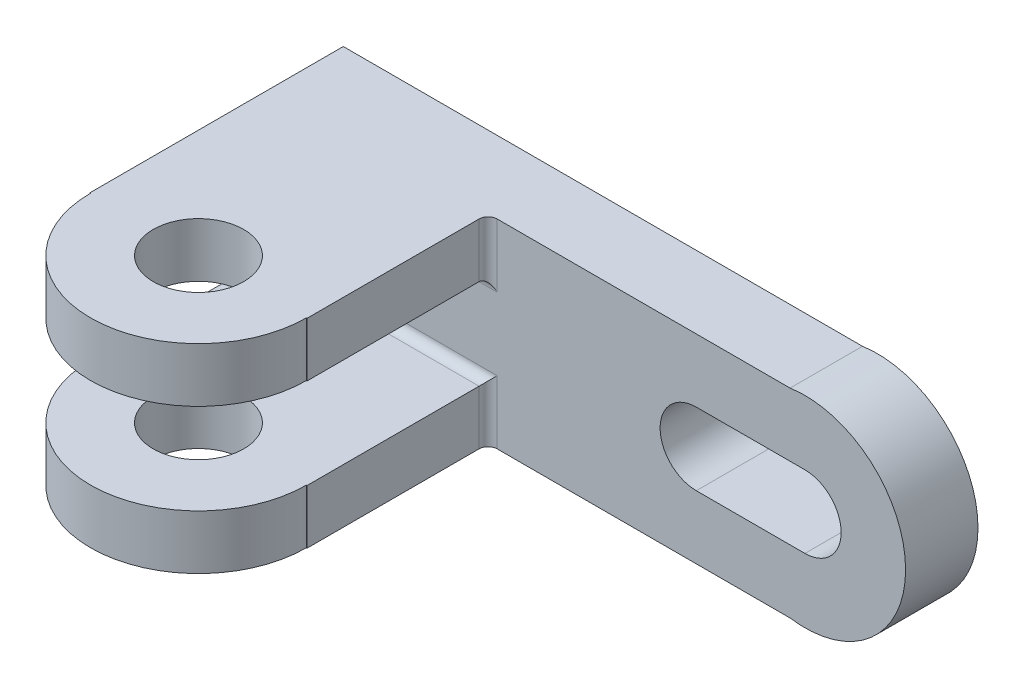
ISO-10303-21;
HEADER;
FILE_DESCRIPTION(('STEP AP214'),'2;1');
FILE_NAME('part.step','',(''),(''),'','','');
FILE_SCHEMA(('AUTOMOTIVE_DESIGN { 1 0 10303 214 1 1 1 1 }'));
ENDSEC;
DATA;
#1=APPLICATION_CONTEXT('core data for automotive mechanical design processes');
#2=APPLICATION_PROTOCOL_DEFINITION('international standard','automotive_design',2000,#1);
#3=PRODUCT_CONTEXT('',#1,'mechanical');
#4=PRODUCT('Part','Part','',(#3));
#5=PRODUCT_RELATED_PRODUCT_CATEGORY('part','',(#4));
#6=PRODUCT_DEFINITION_FORMATION('','',#4);
#7=PRODUCT_DEFINITION_CONTEXT('part definition',#1,'design');
#8=PRODUCT_DEFINITION('design','',#6,#7);
#9=PRODUCT_DEFINITION_SHAPE('','',#8);
#10=(LENGTH_UNIT() NAMED_UNIT(*) SI_UNIT(.MILLI.,.METRE.));
#11=(NAMED_UNIT(*) PLANE_ANGLE_UNIT() SI_UNIT($,.RADIAN.));
#12=(NAMED_UNIT(*) SI_UNIT($,.STERADIAN.) SOLID_ANGLE_UNIT());
#13=UNCERTAINTY_MEASURE_WITH_UNIT(LENGTH_MEASURE(1.E-05),#10,'distance_accuracy_value','');
#14=(GEOMETRIC_REPRESENTATION_CONTEXT(3) GLOBAL_UNCERTAINTY_ASSIGNED_CONTEXT((#13)) GLOBAL_UNIT_ASSIGNED_CONTEXT((#10,
#11,#12)) REPRESENTATION_CONTEXT('',''));
#15=CARTESIAN_POINT('',(0.,0.,0.));
#16=DIRECTION('',(0.,0.,1.));
#17=DIRECTION('',(1.,0.,0.));
#18=AXIS2_PLACEMENT_3D('',#15,#16,#17);
#19=CARTESIAN_POINT('',(0.,0.,16.));
#20=DIRECTION('',(0.,0.,-1.));
#21=DIRECTION('',(-1.,0.,0.));
#22=AXIS2_PLACEMENT_3D('',#19,#20,#21);
#23=PLANE('',#22);
#24=DIRECTION('',(-1.,0.,0.));
#25=VECTOR('',#24,1.);
#26=CARTESIAN_POINT('',(76.0770186335404,3.76149068322982,16.));
#27=LINE('',#26,#25);
#28=CARTESIAN_POINT('',(76.0770186335404,3.76149068322982,16.));
#29=VERTEX_POINT('',#28);
#30=CARTESIAN_POINT('',(52.0770186335404,3.76149068322981,16.));
#31=VERTEX_POINT('',#30);
#32=EDGE_CURVE('E330',#29,#31,#27,.T.);
#33=ORIENTED_EDGE('',*,*,#32,.F.);
#34=CARTESIAN_POINT('',(76.0770186335404,-4.23850931677018,16.));
#35=DIRECTION('',(0.,0.,1.));
#36=DIRECTION('',(1.,0.,0.));
#37=AXIS2_PLACEMENT_3D('',#34,#35,#36);
#38=CIRCLE('',#37,8.);
#39=CARTESIAN_POINT('',(76.0770186335404,-12.2385093167702,16.));
#40=VERTEX_POINT('',#39);
#41=EDGE_CURVE('E315',#40,#29,#38,.T.);
#42=ORIENTED_EDGE('',*,*,#41,.F.);
#43=DIRECTION('',(-1.,0.,0.));
#44=VECTOR('',#43,1.);
#45=CARTESIAN_POINT('',(76.0770186335404,-12.2385093167702,16.));
#46=LINE('',#45,#44);
#47=CARTESIAN_POINT('',(52.0770186335404,-12.2385093167702,16.));
#48=VERTEX_POINT('',#47);
#49=EDGE_CURVE('E320',#40,#48,#46,.T.);
#50=ORIENTED_EDGE('',*,*,#49,.T.);
#51=CARTESIAN_POINT('',(52.0770186335404,-4.23850931677018,16.));
#52=DIRECTION('',(0.,0.,1.));
#53=DIRECTION('',(1.,0.,0.));
#54=AXIS2_PLACEMENT_3D('',#51,#52,#53);
#55=CIRCLE('',#54,8.);
#56=EDGE_CURVE('E333',#31,#48,#55,.T.);
#57=ORIENTED_EDGE('',*,*,#56,.F.);
#58=EDGE_LOOP('',(#33,#42,#50,#57));
#59=FACE_BOUND('',#58,.T.);
#60=DIRECTION('',(0.,1.,0.));
#61=VECTOR('',#60,1.);
#62=CARTESIAN_POINT('',(8.0770186335404,0.,16.));
#63=LINE('',#62,#61);
#64=CARTESIAN_POINT('',(8.0770186335404,17.7614906832298,16.));
#65=VERTEX_POINT('',#64);
#66=CARTESIAN_POINT('',(8.0770186335404,3.76149068322982,16.));
#67=VERTEX_POINT('',#66);
#68=EDGE_CURVE('E385',#65,#67,#63,.F.);
#69=ORIENTED_EDGE('',*,*,#68,.T.);
#70=DIRECTION('',(-1.,0.,0.));
#71=VECTOR('',#70,1.);
#72=CARTESIAN_POINT('',(-41.9229813664596,3.76149068322982,16.));
#73=LINE('',#72,#71);
#74=CARTESIAN_POINT('',(-41.9229813664596,3.76149068322982,16.));
#75=VERTEX_POINT('',#74);
#76=EDGE_CURVE('E387',#67,#75,#73,.T.);
#77=ORIENTED_EDGE('',*,*,#76,.T.);
#78=DIRECTION('',(0.,-1.,0.));
#79=VECTOR('',#78,1.);
#80=CARTESIAN_POINT('',(-41.9229813664596,-26.2385093167702,16.));
#81=LINE('',#80,#79);
#82=CARTESIAN_POINT('',(-41.9229813664596,-12.2385093167702,16.));
#83=VERTEX_POINT('',#82);
#84=EDGE_CURVE('E357',#75,#83,#81,.T.);
#85=ORIENTED_EDGE('',*,*,#84,.T.);
#86=DIRECTION('',(-1.,0.,0.));
#87=VECTOR('',#86,1.);
#88=CARTESIAN_POINT('',(6.0770186335404,-12.2385093167702,16.));
#89=LINE('',#88,#87);
#90=CARTESIAN_POINT('',(8.0770186335404,-12.2385093167702,16.));
#91=VERTEX_POINT('',#90);
#92=EDGE_CURVE('E383',#83,#91,#89,.F.);
#93=ORIENTED_EDGE('',*,*,#92,.T.);
#94=DIRECTION('',(0.,-1.,0.));
#95=VECTOR('',#94,1.);
#96=CARTESIAN_POINT('',(8.0770186335404,-26.2385093167702,16.));
#97=LINE('',#96,#95);
#98=CARTESIAN_POINT('',(8.0770186335404,-26.2385093167702,16.));
#99=VERTEX_POINT('',#98);
#100=EDGE_CURVE('E381',#91,#99,#97,.T.);
#101=ORIENTED_EDGE('',*,*,#100,.T.);
#102=DIRECTION('',(1.,0.,0.));
#103=VECTOR('',#102,1.);
#104=CARTESIAN_POINT('',(-41.9229813664596,-26.2385093167702,16.));
#105=LINE('',#104,#103);
#106=CARTESIAN_POINT('',(72.8015354385656,-26.2385093167702,16.));
#107=VERTEX_POINT('',#106);
#108=EDGE_CURVE('E360',#99,#107,#105,.T.);
#109=ORIENTED_EDGE('',*,*,#108,.T.);
#110=CARTESIAN_POINT('',(76.0770186335404,-4.23850931677018,16.));
#111=DIRECTION('',(0.,0.,1.));
#112=DIRECTION('',(1.,0.,0.));
#113=AXIS2_PLACEMENT_3D('',#110,#111,#112);
#114=CIRCLE('',#113,22.2424996383177);
#115=CARTESIAN_POINT('',(72.8015354385656,17.7614906832298,16.));
#116=VERTEX_POINT('',#115);
#117=EDGE_CURVE('E340',#107,#116,#114,.T.);
#118=ORIENTED_EDGE('',*,*,#117,.T.);
#119=DIRECTION('',(-1.,0.,0.));
#120=VECTOR('',#119,1.);
#121=CARTESIAN_POINT('',(-41.9229813664596,17.7614906832298,16.));
#122=LINE('',#121,#120);
#123=EDGE_CURVE('E363',#116,#65,#122,.T.);
#124=ORIENTED_EDGE('',*,*,#123,.T.);
#125=EDGE_LOOP('',(#69,#77,#85,#93,#101,#109,#118,#124));
#126=FACE_BOUND('',#125,.T.);
#127=ADVANCED_FACE('F80',(#59,#126),#23,.F.);
#128=CARTESIAN_POINT('',(-41.9229813664596,-26.2385093167702,16.));
#129=DIRECTION('',(1.,0.,0.));
#130=DIRECTION('',(0.,0.,-1.));
#131=AXIS2_PLACEMENT_3D('',#128,#129,#130);
#132=PLANE('',#131);
#133=DIRECTION('',(0.,-1.,0.));
#134=VECTOR('',#133,1.);
#135=CARTESIAN_POINT('',(-41.9229813664596,-26.2385093167702,0.));
#136=LINE('',#135,#134);
#137=CARTESIAN_POINT('',(-41.9229813664596,17.7614906832298,0.));
#138=VERTEX_POINT('',#137);
#139=CARTESIAN_POINT('',(-41.9229813664596,-26.2385093167702,0.));
#140=VERTEX_POINT('',#139);
#141=EDGE_CURVE('E356',#138,#140,#136,.T.);
#142=ORIENTED_EDGE('',*,*,#141,.T.);
#143=DIRECTION('',(0.,0.,-1.));
#144=VECTOR('',#143,1.);
#145=CARTESIAN_POINT('',(-41.9229813664596,-26.2385093167702,16.));
#146=LINE('',#145,#144);
#147=CARTESIAN_POINT('',(-41.9229813664596,-26.2385093167702,56.));
#148=VERTEX_POINT('',#147);
#149=EDGE_CURVE('E375',#148,#140,#146,.T.);
#150=ORIENTED_EDGE('',*,*,#149,.F.);
#151=DIRECTION('',(0.,-1.,0.));
#152=VECTOR('',#151,1.);
#153=CARTESIAN_POINT('',(-41.9229813664596,-14.2385093167702,56.));
#154=LINE('',#153,#152);
#155=CARTESIAN_POINT('',(-41.9229813664596,-14.2385093167702,56.));
#156=VERTEX_POINT('',#155);
#157=EDGE_CURVE('E309',#156,#148,#154,.T.);
#158=ORIENTED_EDGE('',*,*,#157,.F.);
#159=DIRECTION('',(0.,0.,1.));
#160=VECTOR('',#159,1.);
#161=CARTESIAN_POINT('',(-41.9229813664596,-14.2385093167702,16.));
#162=LINE('',#161,#160);
#163=CARTESIAN_POINT('',(-41.9229813664596,-14.2385093167702,18.));
#164=VERTEX_POINT('',#163);
#165=EDGE_CURVE('E289',#164,#156,#162,.T.);
#166=ORIENTED_EDGE('',*,*,#165,.F.);
#167=CARTESIAN_POINT('',(-41.9229813664596,-12.2385093167702,18.));
#168=DIRECTION('',(1.,0.,0.));
#169=DIRECTION('',(0.,0.,-1.));
#170=AXIS2_PLACEMENT_3D('',#167,#168,#169);
#171=CIRCLE('',#170,2.);
#172=EDGE_CURVE('E395',#164,#83,#171,.T.);
#173=ORIENTED_EDGE('',*,*,#172,.T.);
#174=ORIENTED_EDGE('',*,*,#84,.F.);
#175=CARTESIAN_POINT('',(-41.9229813664596,3.76149068322982,18.));
#176=DIRECTION('',(1.,0.,0.));
#177=DIRECTION('',(0.,0.,-1.));
#178=AXIS2_PLACEMENT_3D('',#175,#176,#177);
#179=CIRCLE('',#178,2.);
#180=CARTESIAN_POINT('',(-41.9229813664596,5.76149068322982,18.));
#181=VERTEX_POINT('',#180);
#182=EDGE_CURVE('E397',#75,#181,#179,.T.);
#183=ORIENTED_EDGE('',*,*,#182,.T.);
#184=DIRECTION('',(0.,0.,1.));
#185=VECTOR('',#184,1.);
#186=CARTESIAN_POINT('',(-41.9229813664596,5.76149068322982,16.));
#187=LINE('',#186,#185);
#188=CARTESIAN_POINT('',(-41.9229813664596,5.76149068322982,56.));
#189=VERTEX_POINT('',#188);
#190=EDGE_CURVE('E261',#181,#189,#187,.T.);
#191=ORIENTED_EDGE('',*,*,#190,.T.);
#192=DIRECTION('',(0.,1.,0.));
#193=VECTOR('',#192,1.);
#194=CARTESIAN_POINT('',(-41.9229813664596,5.76149068322982,56.));
#195=LINE('',#194,#193);
#196=CARTESIAN_POINT('',(-41.9229813664596,17.7614906832298,56.));
#197=VERTEX_POINT('',#196);
#198=EDGE_CURVE('E272',#189,#197,#195,.T.);
#199=ORIENTED_EDGE('',*,*,#198,.T.);
#200=DIRECTION('',(0.,0.,-1.));
#201=VECTOR('',#200,1.);
#202=CARTESIAN_POINT('',(-41.9229813664596,17.7614906832298,16.));
#203=LINE('',#202,#201);
#204=EDGE_CURVE('E366',#197,#138,#203,.T.);
#205=ORIENTED_EDGE('',*,*,#204,.T.);
#206=EDGE_LOOP('',(#142,#150,#158,#166,#173,#174,#183,#191,#199,#205));
#207=FACE_BOUND('',#206,.T.);
#208=ADVANCED_FACE('F430',(#207),#132,.F.);
#209=CARTESIAN_POINT('',(-41.9229813664596,-26.2385093167702,16.));
#210=DIRECTION('',(0.,1.,0.));
#211=DIRECTION('',(0.,0.,1.));
#212=AXIS2_PLACEMENT_3D('',#209,#210,#211);
#213=PLANE('',#212);
#214=DIRECTION('',(1.,0.,0.));
#215=VECTOR('',#214,1.);
#216=CARTESIAN_POINT('',(-41.9229813664596,-26.2385093167702,0.));
#217=LINE('',#216,#215);
#218=CARTESIAN_POINT('',(72.8015354385656,-26.2385093167702,0.));
#219=VERTEX_POINT('',#218);
#220=EDGE_CURVE('E369',#140,#219,#217,.T.);
#221=ORIENTED_EDGE('',*,*,#220,.T.);
#222=DIRECTION('',(0.,0.,1.));
#223=VECTOR('',#222,1.);
#224=CARTESIAN_POINT('',(72.8015354385656,-26.2385093167702,0.));
#225=LINE('',#224,#223);
#226=EDGE_CURVE('E353',#219,#107,#225,.T.);
#227=ORIENTED_EDGE('',*,*,#226,.T.);
#228=ORIENTED_EDGE('',*,*,#108,.F.);
#229=CARTESIAN_POINT('',(8.0770186335404,-26.2385093167702,18.));
#230=DIRECTION('',(0.,1.,0.));
#231=DIRECTION('',(0.,0.,1.));
#232=AXIS2_PLACEMENT_3D('',#229,#230,#231);
#233=CIRCLE('',#232,2.);
#234=CARTESIAN_POINT('',(6.0770186335404,-26.2385093167702,18.));
#235=VERTEX_POINT('',#234);
#236=EDGE_CURVE('E12',#99,#235,#233,.T.);
#237=ORIENTED_EDGE('',*,*,#236,.T.);
#238=DIRECTION('',(0.,0.,-1.));
#239=VECTOR('',#238,1.);
#240=CARTESIAN_POINT('',(6.07701863354039,-26.2385093167702,56.));
#241=LINE('',#240,#239);
#242=CARTESIAN_POINT('',(6.07701863354039,-26.2385093167702,56.));
#243=VERTEX_POINT('',#242);
#244=EDGE_CURVE('E299',#243,#235,#241,.T.);
#245=ORIENTED_EDGE('',*,*,#244,.F.);
#246=DIRECTION('',(1.,0.,0.));
#247=VECTOR('',#246,1.);
#248=CARTESIAN_POINT('',(5.92826068673189,-26.2385093167702,56.));
#249=LINE('',#248,#247);
#250=CARTESIAN_POINT('',(5.9282606867319,-26.2385093167702,56.));
#251=VERTEX_POINT('',#250);
#252=EDGE_CURVE('E279',#251,#243,#249,.T.);
#253=ORIENTED_EDGE('',*,*,#252,.F.);
#254=CARTESIAN_POINT('',(-17.9229813664596,-26.2385093167702,56.));
#255=DIRECTION('',(0.,-1.,0.));
#256=DIRECTION('',(0.,0.,-1.));
#257=AXIS2_PLACEMENT_3D('',#254,#255,#256);
#258=CIRCLE('',#257,23.8512420531915);
#259=CARTESIAN_POINT('',(-41.7742234196511,-26.2385093167702,56.));
#260=VERTEX_POINT('',#259);
#261=EDGE_CURVE('E286',#251,#260,#258,.T.);
#262=ORIENTED_EDGE('',*,*,#261,.T.);
#263=DIRECTION('',(1.,0.,0.));
#264=VECTOR('',#263,1.);
#265=CARTESIAN_POINT('',(-41.9229813664596,-26.2385093167702,56.));
#266=LINE('',#265,#264);
#267=EDGE_CURVE('E301',#148,#260,#266,.T.);
#268=ORIENTED_EDGE('',*,*,#267,.F.);
#269=ORIENTED_EDGE('',*,*,#149,.T.);
#270=EDGE_LOOP('',(#221,#227,#228,#237,#245,#253,#262,#268,#269));
#271=FACE_BOUND('',#270,.T.);
#272=CARTESIAN_POINT('',(-17.9229813664596,-26.2385093167702,56.));
#273=DIRECTION('',(0.,-1.,0.));
#274=DIRECTION('',(0.,0.,-1.));
#275=AXIS2_PLACEMENT_3D('',#272,#273,#274);
#276=CIRCLE('',#275,10.);
#277=CARTESIAN_POINT('',(-17.9229813664596,-26.2385093167702,46.));
#278=VERTEX_POINT('',#277);
#279=EDGE_CURVE('E237',#278,#278,#276,.T.);
#280=ORIENTED_EDGE('',*,*,#279,.F.);
#281=EDGE_LOOP('',(#280));
#282=FACE_BOUND('',#281,.T.);
#283=ADVANCED_FACE('F461',(#271,#282),#213,.F.);
#284=CARTESIAN_POINT('',(-41.9229813664596,17.7614906832298,16.));
#285=DIRECTION('',(0.,-1.,0.));
#286=DIRECTION('',(0.,0.,-1.));
#287=AXIS2_PLACEMENT_3D('',#284,#285,#286);
#288=PLANE('',#287);
#289=ORIENTED_EDGE('',*,*,#123,.F.);
#290=DIRECTION('',(0.,0.,1.));
#291=VECTOR('',#290,1.);
#292=CARTESIAN_POINT('',(72.8015354385656,17.7614906832298,0.));
#293=LINE('',#292,#291);
#294=CARTESIAN_POINT('',(72.8015354385656,17.7614906832298,0.));
#295=VERTEX_POINT('',#294);
#296=EDGE_CURVE('E349',#116,#295,#293,.F.);
#297=ORIENTED_EDGE('',*,*,#296,.T.);
#298=DIRECTION('',(-1.,0.,0.));
#299=VECTOR('',#298,1.);
#300=CARTESIAN_POINT('',(-41.9229813664596,17.7614906832298,0.));
#301=LINE('',#300,#299);
#302=EDGE_CURVE('E361',#295,#138,#301,.T.);
#303=ORIENTED_EDGE('',*,*,#302,.T.);
#304=ORIENTED_EDGE('',*,*,#204,.F.);
#305=DIRECTION('',(1.,0.,0.));
#306=VECTOR('',#305,1.);
#307=CARTESIAN_POINT('',(-41.9229813664596,17.7614906832298,56.));
#308=LINE('',#307,#306);
#309=CARTESIAN_POINT('',(-41.7742234196511,17.7614906832298,56.));
#310=VERTEX_POINT('',#309);
#311=EDGE_CURVE('E254',#197,#310,#308,.T.);
#312=ORIENTED_EDGE('',*,*,#311,.T.);
#313=CARTESIAN_POINT('',(-17.9229813664596,17.7614906832298,56.));
#314=DIRECTION('',(0.,-1.,0.));
#315=DIRECTION('',(0.,0.,-1.));
#316=AXIS2_PLACEMENT_3D('',#313,#314,#315);
#317=CIRCLE('',#316,23.8512420531915);
#318=CARTESIAN_POINT('',(5.9282606867319,17.7614906832298,56.));
#319=VERTEX_POINT('',#318);
#320=EDGE_CURVE('E266',#319,#310,#317,.T.);
#321=ORIENTED_EDGE('',*,*,#320,.F.);
#322=DIRECTION('',(1.,0.,0.));
#323=VECTOR('',#322,1.);
#324=CARTESIAN_POINT('',(5.92826068673189,17.7614906832298,56.));
#325=LINE('',#324,#323);
#326=CARTESIAN_POINT('',(6.07701863354039,17.7614906832298,56.));
#327=VERTEX_POINT('',#326);
#328=EDGE_CURVE('E233',#319,#327,#325,.T.);
#329=ORIENTED_EDGE('',*,*,#328,.T.);
#330=DIRECTION('',(0.,0.,-1.));
#331=VECTOR('',#330,1.);
#332=CARTESIAN_POINT('',(6.07701863354039,17.7614906832298,56.));
#333=LINE('',#332,#331);
#334=CARTESIAN_POINT('',(6.0770186335404,17.7614906832298,18.));
#335=VERTEX_POINT('',#334);
#336=EDGE_CURVE('E252',#327,#335,#333,.T.);
#337=ORIENTED_EDGE('',*,*,#336,.T.);
#338=CARTESIAN_POINT('',(8.0770186335404,17.7614906832298,18.));
#339=DIRECTION('',(0.,-1.,0.));
#340=DIRECTION('',(0.,0.,-1.));
#341=AXIS2_PLACEMENT_3D('',#338,#339,#340);
#342=CIRCLE('',#341,2.);
#343=EDGE_CURVE('E89',#335,#65,#342,.T.);
#344=ORIENTED_EDGE('',*,*,#343,.T.);
#345=EDGE_LOOP('',(#289,#297,#303,#304,#312,#321,#329,#337,#344));
#346=FACE_BOUND('',#345,.T.);
#347=CARTESIAN_POINT('',(-17.9229813664596,17.7614906832298,56.));
#348=DIRECTION('',(0.,-1.,0.));
#349=DIRECTION('',(0.,0.,-1.));
#350=AXIS2_PLACEMENT_3D('',#347,#348,#349);
#351=CIRCLE('',#350,10.);
#352=CARTESIAN_POINT('',(-17.9229813664596,17.7614906832298,46.));
#353=VERTEX_POINT('',#352);
#354=EDGE_CURVE('E257',#353,#353,#351,.T.);
#355=ORIENTED_EDGE('',*,*,#354,.T.);
#356=EDGE_LOOP('',(#355));
#357=FACE_BOUND('',#356,.T.);
#358=ADVANCED_FACE('F417',(#346,#357),#288,.F.);
#359=CARTESIAN_POINT('',(0.,0.,0.));
#360=DIRECTION('',(0.,0.,-1.));
#361=DIRECTION('',(-1.,0.,0.));
#362=AXIS2_PLACEMENT_3D('',#359,#360,#361);
#363=PLANE('',#362);
#364=CARTESIAN_POINT('',(76.0770186335404,-4.23850931677018,0.));
#365=DIRECTION('',(0.,0.,1.));
#366=DIRECTION('',(1.,0.,0.));
#367=AXIS2_PLACEMENT_3D('',#364,#365,#366);
#368=CIRCLE('',#367,8.);
#369=CARTESIAN_POINT('',(76.0770186335404,-12.2385093167702,0.));
#370=VERTEX_POINT('',#369);
#371=CARTESIAN_POINT('',(76.0770186335404,3.76149068322982,0.));
#372=VERTEX_POINT('',#371);
#373=EDGE_CURVE('E316',#370,#372,#368,.T.);
#374=ORIENTED_EDGE('',*,*,#373,.T.);
#375=DIRECTION('',(-1.,0.,0.));
#376=VECTOR('',#375,1.);
#377=CARTESIAN_POINT('',(76.0770186335404,3.76149068322982,0.));
#378=LINE('',#377,#376);
#379=CARTESIAN_POINT('',(52.0770186335404,3.76149068322981,0.));
#380=VERTEX_POINT('',#379);
#381=EDGE_CURVE('E319',#372,#380,#378,.T.);
#382=ORIENTED_EDGE('',*,*,#381,.T.);
#383=CARTESIAN_POINT('',(52.0770186335404,-4.23850931677018,0.));
#384=DIRECTION('',(0.,0.,1.));
#385=DIRECTION('',(1.,0.,0.));
#386=AXIS2_PLACEMENT_3D('',#383,#384,#385);
#387=CIRCLE('',#386,8.);
#388=CARTESIAN_POINT('',(52.0770186335404,-12.2385093167702,0.));
#389=VERTEX_POINT('',#388);
#390=EDGE_CURVE('E323',#380,#389,#387,.T.);
#391=ORIENTED_EDGE('',*,*,#390,.T.);
#392=DIRECTION('',(-1.,0.,0.));
#393=VECTOR('',#392,1.);
#394=CARTESIAN_POINT('',(76.0770186335404,-12.2385093167702,0.));
#395=LINE('',#394,#393);
#396=EDGE_CURVE('E326',#370,#389,#395,.T.);
#397=ORIENTED_EDGE('',*,*,#396,.F.);
#398=EDGE_LOOP('',(#374,#382,#391,#397));
#399=FACE_BOUND('',#398,.T.);
#400=ORIENTED_EDGE('',*,*,#302,.F.);
#401=CARTESIAN_POINT('',(76.0770186335404,-4.23850931677018,0.));
#402=DIRECTION('',(0.,0.,1.));
#403=DIRECTION('',(1.,0.,0.));
#404=AXIS2_PLACEMENT_3D('',#401,#402,#403);
#405=CIRCLE('',#404,22.2424996383177);
#406=EDGE_CURVE('E347',#219,#295,#405,.T.);
#407=ORIENTED_EDGE('',*,*,#406,.F.);
#408=ORIENTED_EDGE('',*,*,#220,.F.);
#409=ORIENTED_EDGE('',*,*,#141,.F.);
#410=EDGE_LOOP('',(#400,#407,#408,#409));
#411=FACE_BOUND('',#410,.T.);
#412=ADVANCED_FACE('F428',(#399,#411),#363,.T.);
#413=CARTESIAN_POINT('',(76.0770186335404,-4.23850931677018,0.));
#414=DIRECTION('',(0.,0.,1.));
#415=DIRECTION('',(1.,0.,0.));
#416=AXIS2_PLACEMENT_3D('',#413,#414,#415);
#417=CYLINDRICAL_SURFACE('',#416,22.2424996383177);
#418=ORIENTED_EDGE('',*,*,#226,.F.);
#419=ORIENTED_EDGE('',*,*,#406,.T.);
#420=ORIENTED_EDGE('',*,*,#296,.F.);
#421=ORIENTED_EDGE('',*,*,#117,.F.);
#422=EDGE_LOOP('',(#418,#419,#420,#421));
#423=FACE_BOUND('',#422,.T.);
#424=ADVANCED_FACE('F423',(#423),#417,.T.);
#425=CARTESIAN_POINT('',(76.0770186335404,-4.23850931677018,0.));
#426=DIRECTION('',(0.,0.,1.));
#427=DIRECTION('',(1.,0.,0.));
#428=AXIS2_PLACEMENT_3D('',#425,#426,#427);
#429=CYLINDRICAL_SURFACE('',#428,8.);
#430=ORIENTED_EDGE('',*,*,#41,.T.);
#431=DIRECTION('',(0.,0.,1.));
#432=VECTOR('',#431,1.);
#433=CARTESIAN_POINT('',(76.0770186335404,3.76149068322982,0.));
#434=LINE('',#433,#432);
#435=EDGE_CURVE('E328',#372,#29,#434,.T.);
#436=ORIENTED_EDGE('',*,*,#435,.F.);
#437=ORIENTED_EDGE('',*,*,#373,.F.);
#438=DIRECTION('',(0.,0.,1.));
#439=VECTOR('',#438,1.);
#440=CARTESIAN_POINT('',(76.0770186335404,-12.2385093167702,0.));
#441=LINE('',#440,#439);
#442=EDGE_CURVE('E338',#370,#40,#441,.T.);
#443=ORIENTED_EDGE('',*,*,#442,.T.);
#444=EDGE_LOOP('',(#430,#436,#437,#443));
#445=FACE_BOUND('',#444,.T.);
#446=ADVANCED_FACE('F649',(#445),#429,.F.);
#447=CARTESIAN_POINT('',(76.0770186335404,-12.2385093167702,0.));
#448=DIRECTION('',(0.,1.,0.));
#449=DIRECTION('',(-1.,0.,0.));
#450=AXIS2_PLACEMENT_3D('',#447,#448,#449);
#451=PLANE('',#450);
#452=ORIENTED_EDGE('',*,*,#49,.F.);
#453=ORIENTED_EDGE('',*,*,#442,.F.);
#454=ORIENTED_EDGE('',*,*,#396,.T.);
#455=DIRECTION('',(0.,0.,1.));
#456=VECTOR('',#455,1.);
#457=CARTESIAN_POINT('',(52.0770186335404,-12.2385093167702,0.));
#458=LINE('',#457,#456);
#459=EDGE_CURVE('E341',#389,#48,#458,.T.);
#460=ORIENTED_EDGE('',*,*,#459,.T.);
#461=EDGE_LOOP('',(#452,#453,#454,#460));
#462=FACE_BOUND('',#461,.T.);
#463=ADVANCED_FACE('F639',(#462),#451,.T.);
#464=CARTESIAN_POINT('',(52.0770186335404,-4.23850931677018,0.));
#465=DIRECTION('',(0.,0.,1.));
#466=DIRECTION('',(1.,0.,0.));
#467=AXIS2_PLACEMENT_3D('',#464,#465,#466);
#468=CYLINDRICAL_SURFACE('',#467,8.);
#469=ORIENTED_EDGE('',*,*,#56,.T.);
#470=ORIENTED_EDGE('',*,*,#459,.F.);
#471=ORIENTED_EDGE('',*,*,#390,.F.);
#472=DIRECTION('',(0.,0.,1.));
#473=VECTOR('',#472,1.);
#474=CARTESIAN_POINT('',(52.0770186335404,3.76149068322981,0.));
#475=LINE('',#474,#473);
#476=EDGE_CURVE('E343',#380,#31,#475,.T.);
#477=ORIENTED_EDGE('',*,*,#476,.T.);
#478=EDGE_LOOP('',(#469,#470,#471,#477));
#479=FACE_BOUND('',#478,.T.);
#480=ADVANCED_FACE('F629',(#479),#468,.F.);
#481=CARTESIAN_POINT('',(76.0770186335404,3.76149068322982,0.));
#482=DIRECTION('',(0.,1.,0.));
#483=DIRECTION('',(-1.,0.,0.));
#484=AXIS2_PLACEMENT_3D('',#481,#482,#483);
#485=PLANE('',#484);
#486=ORIENTED_EDGE('',*,*,#32,.T.);
#487=ORIENTED_EDGE('',*,*,#476,.F.);
#488=ORIENTED_EDGE('',*,*,#381,.F.);
#489=ORIENTED_EDGE('',*,*,#435,.T.);
#490=EDGE_LOOP('',(#486,#487,#488,#489));
#491=FACE_BOUND('',#490,.T.);
#492=ADVANCED_FACE('F620',(#491),#485,.F.);
#493=CARTESIAN_POINT('',(5.92826068673189,-14.2385093167702,56.));
#494=DIRECTION('',(0.,0.,-1.));
#495=DIRECTION('',(-1.,0.,0.));
#496=AXIS2_PLACEMENT_3D('',#493,#494,#495);
#497=PLANE('',#496);
#498=ORIENTED_EDGE('',*,*,#252,.T.);
#499=DIRECTION('',(0.,-1.,0.));
#500=VECTOR('',#499,1.);
#501=CARTESIAN_POINT('',(6.07701863354039,-14.2385093167702,56.));
#502=LINE('',#501,#500);
#503=CARTESIAN_POINT('',(6.07701863354039,-14.2385093167702,56.));
#504=VERTEX_POINT('',#503);
#505=EDGE_CURVE('E312',#504,#243,#502,.T.);
#506=ORIENTED_EDGE('',*,*,#505,.F.);
#507=DIRECTION('',(1.,0.,0.));
#508=VECTOR('',#507,1.);
#509=CARTESIAN_POINT('',(5.92826068673189,-14.2385093167702,56.));
#510=LINE('',#509,#508);
#511=CARTESIAN_POINT('',(5.9282606867319,-14.2385093167702,56.));
#512=VERTEX_POINT('',#511);
#513=EDGE_CURVE('E282',#512,#504,#510,.T.);
#514=ORIENTED_EDGE('',*,*,#513,.F.);
#515=DIRECTION('',(0.,-1.,0.));
#516=VECTOR('',#515,1.);
#517=CARTESIAN_POINT('',(5.9282606867319,-14.2385093167702,56.));
#518=LINE('',#517,#516);
#519=EDGE_CURVE('E296',#512,#251,#518,.T.);
#520=ORIENTED_EDGE('',*,*,#519,.T.);
#521=EDGE_LOOP('',(#498,#506,#514,#520));
#522=FACE_BOUND('',#521,.T.);
#523=ADVANCED_FACE('F455',(#522),#497,.F.);
#524=CARTESIAN_POINT('',(6.07701863354039,-14.2385093167702,56.));
#525=DIRECTION('',(-1.,0.,0.));
#526=DIRECTION('',(0.,0.,1.));
#527=AXIS2_PLACEMENT_3D('',#524,#525,#526);
#528=PLANE('',#527);
#529=ORIENTED_EDGE('',*,*,#244,.T.);
#530=DIRECTION('',(0.,-1.,0.));
#531=VECTOR('',#530,1.);
#532=CARTESIAN_POINT('',(6.0770186335404,-14.2385093167702,18.));
#533=LINE('',#532,#531);
#534=CARTESIAN_POINT('',(6.0770186335404,-14.2385093167702,18.));
#535=VERTEX_POINT('',#534);
#536=EDGE_CURVE('E393',#235,#535,#533,.F.);
#537=ORIENTED_EDGE('',*,*,#536,.T.);
#538=DIRECTION('',(0.,0.,-1.));
#539=VECTOR('',#538,1.);
#540=CARTESIAN_POINT('',(6.07701863354039,-14.2385093167702,56.));
#541=LINE('',#540,#539);
#542=EDGE_CURVE('E285',#504,#535,#541,.T.);
#543=ORIENTED_EDGE('',*,*,#542,.F.);
#544=ORIENTED_EDGE('',*,*,#505,.T.);
#545=EDGE_LOOP('',(#529,#537,#543,#544));
#546=FACE_BOUND('',#545,.T.);
#547=ADVANCED_FACE('F457',(#546),#528,.F.);
#548=CARTESIAN_POINT('',(-41.9229813664596,-14.2385093167702,56.));
#549=DIRECTION('',(0.,0.,-1.));
#550=DIRECTION('',(-1.,0.,0.));
#551=AXIS2_PLACEMENT_3D('',#548,#549,#550);
#552=PLANE('',#551);
#553=ORIENTED_EDGE('',*,*,#267,.T.);
#554=DIRECTION('',(0.,-1.,0.));
#555=VECTOR('',#554,1.);
#556=CARTESIAN_POINT('',(-41.7742234196511,-14.2385093167702,56.));
#557=LINE('',#556,#555);
#558=CARTESIAN_POINT('',(-41.7742234196511,-14.2385093167702,56.));
#559=VERTEX_POINT('',#558);
#560=EDGE_CURVE('E307',#559,#260,#557,.T.);
#561=ORIENTED_EDGE('',*,*,#560,.F.);
#562=DIRECTION('',(1.,0.,0.));
#563=VECTOR('',#562,1.);
#564=CARTESIAN_POINT('',(-41.9229813664596,-14.2385093167702,56.));
#565=LINE('',#564,#563);
#566=EDGE_CURVE('E291',#156,#559,#565,.T.);
#567=ORIENTED_EDGE('',*,*,#566,.F.);
#568=ORIENTED_EDGE('',*,*,#157,.T.);
#569=EDGE_LOOP('',(#553,#561,#567,#568));
#570=FACE_BOUND('',#569,.T.);
#571=ADVANCED_FACE('F446',(#570),#552,.F.);
#572=CARTESIAN_POINT('',(-17.9229813664596,-14.2385093167702,56.));
#573=DIRECTION('',(0.,-1.,0.));
#574=DIRECTION('',(0.,0.,-1.));
#575=AXIS2_PLACEMENT_3D('',#572,#573,#574);
#576=CYLINDRICAL_SURFACE('',#575,23.8512420531915);
#577=ORIENTED_EDGE('',*,*,#261,.F.);
#578=ORIENTED_EDGE('',*,*,#519,.F.);
#579=CARTESIAN_POINT('',(-17.9229813664596,-14.2385093167702,56.));
#580=DIRECTION('',(0.,-1.,0.));
#581=DIRECTION('',(0.,0.,-1.));
#582=AXIS2_PLACEMENT_3D('',#579,#580,#581);
#583=CIRCLE('',#582,23.8512420531915);
#584=EDGE_CURVE('E293',#512,#559,#583,.T.);
#585=ORIENTED_EDGE('',*,*,#584,.T.);
#586=ORIENTED_EDGE('',*,*,#560,.T.);
#587=EDGE_LOOP('',(#577,#578,#585,#586));
#588=FACE_BOUND('',#587,.T.);
#589=ADVANCED_FACE('F452',(#588),#576,.T.);
#590=CARTESIAN_POINT('',(-17.9229813664596,-14.2385093167702,56.));
#591=DIRECTION('',(0.,-1.,0.));
#592=DIRECTION('',(0.,0.,-1.));
#593=AXIS2_PLACEMENT_3D('',#590,#591,#592);
#594=PLANE('',#593);
#595=CARTESIAN_POINT('',(-17.9229813664596,-14.2385093167702,56.));
#596=DIRECTION('',(0.,-1.,0.));
#597=DIRECTION('',(0.,0.,-1.));
#598=AXIS2_PLACEMENT_3D('',#595,#596,#597);
#599=CIRCLE('',#598,10.);
#600=CARTESIAN_POINT('',(-17.9229813664596,-14.2385093167702,46.));
#601=VERTEX_POINT('',#600);
#602=EDGE_CURVE('E276',#601,#601,#599,.T.);
#603=ORIENTED_EDGE('',*,*,#602,.T.);
#604=EDGE_LOOP('',(#603));
#605=FACE_BOUND('',#604,.T.);
#606=ORIENTED_EDGE('',*,*,#542,.T.);
#607=DIRECTION('',(-1.,0.,0.));
#608=VECTOR('',#607,1.);
#609=CARTESIAN_POINT('',(-41.9229813664596,-14.2385093167702,18.));
#610=LINE('',#609,#608);
#611=EDGE_CURVE('E378',#535,#164,#610,.T.);
#612=ORIENTED_EDGE('',*,*,#611,.T.);
#613=ORIENTED_EDGE('',*,*,#165,.T.);
#614=ORIENTED_EDGE('',*,*,#566,.T.);
#615=ORIENTED_EDGE('',*,*,#584,.F.);
#616=ORIENTED_EDGE('',*,*,#513,.T.);
#617=EDGE_LOOP('',(#606,#612,#613,#614,#615,#616));
#618=FACE_BOUND('',#617,.T.);
#619=ADVANCED_FACE('F441',(#605,#618),#594,.F.);
#620=CARTESIAN_POINT('',(-17.9229813664596,-14.2385093167702,56.));
#621=DIRECTION('',(0.,-1.,0.));
#622=DIRECTION('',(0.,0.,-1.));
#623=AXIS2_PLACEMENT_3D('',#620,#621,#622);
#624=CYLINDRICAL_SURFACE('',#623,10.);
#625=ORIENTED_EDGE('',*,*,#602,.F.);
#626=EDGE_LOOP('',(#625));
#627=FACE_BOUND('',#626,.T.);
#628=ORIENTED_EDGE('',*,*,#279,.T.);
#629=EDGE_LOOP('',(#628));
#630=FACE_BOUND('',#629,.T.);
#631=ADVANCED_FACE('F467',(#627,#630),#624,.F.);
#632=CARTESIAN_POINT('',(-17.9229813664596,5.76149068322982,56.));
#633=DIRECTION('',(0.,1.,0.));
#634=DIRECTION('',(0.,0.,-1.));
#635=AXIS2_PLACEMENT_3D('',#632,#633,#634);
#636=PLANE('',#635);
#637=ORIENTED_EDGE('',*,*,#190,.F.);
#638=DIRECTION('',(-1.,0.,0.));
#639=VECTOR('',#638,1.);
#640=CARTESIAN_POINT('',(6.0770186335404,5.76149068322982,18.));
#641=LINE('',#640,#639);
#642=CARTESIAN_POINT('',(6.0770186335404,5.76149068322982,18.));
#643=VERTEX_POINT('',#642);
#644=EDGE_CURVE('E390',#181,#643,#641,.F.);
#645=ORIENTED_EDGE('',*,*,#644,.T.);
#646=DIRECTION('',(0.,0.,-1.));
#647=VECTOR('',#646,1.);
#648=CARTESIAN_POINT('',(6.07701863354039,5.76149068322982,56.));
#649=LINE('',#648,#647);
#650=CARTESIAN_POINT('',(6.07701863354039,5.76149068322982,56.));
#651=VERTEX_POINT('',#650);
#652=EDGE_CURVE('E251',#651,#643,#649,.T.);
#653=ORIENTED_EDGE('',*,*,#652,.F.);
#654=DIRECTION('',(1.,0.,0.));
#655=VECTOR('',#654,1.);
#656=CARTESIAN_POINT('',(5.92826068673189,5.76149068322982,56.));
#657=LINE('',#656,#655);
#658=CARTESIAN_POINT('',(5.9282606867319,5.76149068322982,56.));
#659=VERTEX_POINT('',#658);
#660=EDGE_CURVE('E230',#659,#651,#657,.T.);
#661=ORIENTED_EDGE('',*,*,#660,.F.);
#662=CARTESIAN_POINT('',(-17.9229813664596,5.76149068322982,56.));
#663=DIRECTION('',(0.,-1.,0.));
#664=DIRECTION('',(0.,0.,-1.));
#665=AXIS2_PLACEMENT_3D('',#662,#663,#664);
#666=CIRCLE('',#665,23.8512420531915);
#667=CARTESIAN_POINT('',(-41.7742234196511,5.76149068322982,56.));
#668=VERTEX_POINT('',#667);
#669=EDGE_CURVE('E241',#659,#668,#666,.T.);
#670=ORIENTED_EDGE('',*,*,#669,.T.);
#671=DIRECTION('',(1.,0.,0.));
#672=VECTOR('',#671,1.);
#673=CARTESIAN_POINT('',(-41.9229813664596,5.76149068322982,56.));
#674=LINE('',#673,#672);
#675=EDGE_CURVE('E246',#189,#668,#674,.T.);
#676=ORIENTED_EDGE('',*,*,#675,.F.);
#677=EDGE_LOOP('',(#637,#645,#653,#661,#670,#676));
#678=FACE_BOUND('',#677,.T.);
#679=CARTESIAN_POINT('',(-17.9229813664596,5.76149068322982,56.));
#680=DIRECTION('',(0.,-1.,0.));
#681=DIRECTION('',(0.,0.,-1.));
#682=AXIS2_PLACEMENT_3D('',#679,#680,#681);
#683=CIRCLE('',#682,10.);
#684=CARTESIAN_POINT('',(-17.9229813664596,5.76149068322982,46.));
#685=VERTEX_POINT('',#684);
#686=EDGE_CURVE('E267',#685,#685,#683,.T.);
#687=ORIENTED_EDGE('',*,*,#686,.F.);
#688=EDGE_LOOP('',(#687));
#689=FACE_BOUND('',#688,.T.);
#690=ADVANCED_FACE('F249',(#678,#689),#636,.F.);
#691=CARTESIAN_POINT('',(5.92826068673189,5.76149068322982,56.));
#692=DIRECTION('',(0.,0.,1.));
#693=DIRECTION('',(1.,0.,0.));
#694=AXIS2_PLACEMENT_3D('',#691,#692,#693);
#695=PLANE('',#694);
#696=ORIENTED_EDGE('',*,*,#328,.F.);
#697=DIRECTION('',(0.,1.,0.));
#698=VECTOR('',#697,1.);
#699=CARTESIAN_POINT('',(5.9282606867319,5.76149068322982,56.));
#700=LINE('',#699,#698);
#701=EDGE_CURVE('E226',#659,#319,#700,.T.);
#702=ORIENTED_EDGE('',*,*,#701,.F.);
#703=ORIENTED_EDGE('',*,*,#660,.T.);
#704=DIRECTION('',(0.,1.,0.));
#705=VECTOR('',#704,1.);
#706=CARTESIAN_POINT('',(6.07701863354039,5.76149068322982,56.));
#707=LINE('',#706,#705);
#708=EDGE_CURVE('E264',#651,#327,#707,.T.);
#709=ORIENTED_EDGE('',*,*,#708,.T.);
#710=EDGE_LOOP('',(#696,#702,#703,#709));
#711=FACE_BOUND('',#710,.T.);
#712=ADVANCED_FACE('F228',(#711),#695,.T.);
#713=CARTESIAN_POINT('',(-17.9229813664596,5.76149068322982,56.));
#714=DIRECTION('',(0.,1.,0.));
#715=DIRECTION('',(0.,0.,1.));
#716=AXIS2_PLACEMENT_3D('',#713,#714,#715);
#717=CYLINDRICAL_SURFACE('',#716,23.8512420531915);
#718=ORIENTED_EDGE('',*,*,#320,.T.);
#719=DIRECTION('',(0.,1.,0.));
#720=VECTOR('',#719,1.);
#721=CARTESIAN_POINT('',(-41.7742234196511,5.76149068322982,56.));
#722=LINE('',#721,#720);
#723=EDGE_CURVE('E238',#668,#310,#722,.T.);
#724=ORIENTED_EDGE('',*,*,#723,.F.);
#725=ORIENTED_EDGE('',*,*,#669,.F.);
#726=ORIENTED_EDGE('',*,*,#701,.T.);
#727=EDGE_LOOP('',(#718,#724,#725,#726));
#728=FACE_BOUND('',#727,.T.);
#729=ADVANCED_FACE('F242',(#728),#717,.T.);
#730=CARTESIAN_POINT('',(-41.9229813664596,5.76149068322982,56.));
#731=DIRECTION('',(0.,0.,1.));
#732=DIRECTION('',(1.,0.,0.));
#733=AXIS2_PLACEMENT_3D('',#730,#731,#732);
#734=PLANE('',#733);
#735=ORIENTED_EDGE('',*,*,#311,.F.);
#736=ORIENTED_EDGE('',*,*,#198,.F.);
#737=ORIENTED_EDGE('',*,*,#675,.T.);
#738=ORIENTED_EDGE('',*,*,#723,.T.);
#739=EDGE_LOOP('',(#735,#736,#737,#738));
#740=FACE_BOUND('',#739,.T.);
#741=ADVANCED_FACE('F435',(#740),#734,.T.);
#742=CARTESIAN_POINT('',(6.07701863354039,5.76149068322982,56.));
#743=DIRECTION('',(1.,0.,0.));
#744=DIRECTION('',(0.,0.,-1.));
#745=AXIS2_PLACEMENT_3D('',#742,#743,#744);
#746=PLANE('',#745);
#747=ORIENTED_EDGE('',*,*,#652,.T.);
#748=DIRECTION('',(0.,1.,0.));
#749=VECTOR('',#748,1.);
#750=CARTESIAN_POINT('',(6.0770186335404,5.76149068322982,18.));
#751=LINE('',#750,#749);
#752=EDGE_CURVE('E103',#643,#335,#751,.T.);
#753=ORIENTED_EDGE('',*,*,#752,.T.);
#754=ORIENTED_EDGE('',*,*,#336,.F.);
#755=ORIENTED_EDGE('',*,*,#708,.F.);
#756=EDGE_LOOP('',(#747,#753,#754,#755));
#757=FACE_BOUND('',#756,.T.);
#758=ADVANCED_FACE('F521',(#757),#746,.T.);
#759=CARTESIAN_POINT('',(-17.9229813664596,5.76149068322982,56.));
#760=DIRECTION('',(0.,1.,0.));
#761=DIRECTION('',(0.,0.,1.));
#762=AXIS2_PLACEMENT_3D('',#759,#760,#761);
#763=CYLINDRICAL_SURFACE('',#762,10.);
#764=ORIENTED_EDGE('',*,*,#686,.T.);
#765=EDGE_LOOP('',(#764));
#766=FACE_BOUND('',#765,.T.);
#767=ORIENTED_EDGE('',*,*,#354,.F.);
#768=EDGE_LOOP('',(#767));
#769=FACE_BOUND('',#768,.T.);
#770=ADVANCED_FACE('F499',(#766,#769),#763,.F.);
#771=CARTESIAN_POINT('',(8.0770186335404,0.,18.));
#772=DIRECTION('',(0.,1.,0.));
#773=DIRECTION('',(0.,0.,1.));
#774=AXIS2_PLACEMENT_3D('',#771,#772,#773);
#775=CYLINDRICAL_SURFACE('',#774,2.);
#776=ORIENTED_EDGE('',*,*,#236,.F.);
#777=ORIENTED_EDGE('',*,*,#100,.F.);
#778=CARTESIAN_POINT('',(8.0770186335404,-12.2385093167702,18.));
#779=DIRECTION('',(-0.707106781186547,0.707106781186547,0.));
#780=DIRECTION('',(0.707106781186547,0.707106781186547,0.));
#781=AXIS2_PLACEMENT_3D('',#778,#779,#780);
#782=ELLIPSE('',#781,2.82842712474619,2.);
#783=EDGE_CURVE('E399',#535,#91,#782,.F.);
#784=ORIENTED_EDGE('',*,*,#783,.F.);
#785=ORIENTED_EDGE('',*,*,#536,.F.);
#786=EDGE_LOOP('',(#776,#777,#784,#785));
#787=FACE_BOUND('',#786,.T.);
#788=ADVANCED_FACE('F460',(#787),#775,.F.);
#789=CARTESIAN_POINT('',(-17.9229813664596,-12.2385093167702,18.));
#790=DIRECTION('',(1.,0.,0.));
#791=DIRECTION('',(0.,0.,-1.));
#792=AXIS2_PLACEMENT_3D('',#789,#790,#791);
#793=CYLINDRICAL_SURFACE('',#792,2.);
#794=ORIENTED_EDGE('',*,*,#783,.T.);
#795=ORIENTED_EDGE('',*,*,#92,.F.);
#796=ORIENTED_EDGE('',*,*,#172,.F.);
#797=ORIENTED_EDGE('',*,*,#611,.F.);
#798=EDGE_LOOP('',(#794,#795,#796,#797));
#799=FACE_BOUND('',#798,.T.);
#800=ADVANCED_FACE('F438',(#799),#793,.F.);
#801=CARTESIAN_POINT('',(8.0770186335404,5.76149068322982,18.));
#802=DIRECTION('',(0.,1.,0.));
#803=DIRECTION('',(0.,0.,1.));
#804=AXIS2_PLACEMENT_3D('',#801,#802,#803);
#805=CYLINDRICAL_SURFACE('',#804,2.);
#806=ORIENTED_EDGE('',*,*,#343,.F.);
#807=ORIENTED_EDGE('',*,*,#752,.F.);
#808=CARTESIAN_POINT('',(8.0770186335404,3.76149068322982,18.));
#809=DIRECTION('',(0.707106781186547,0.707106781186547,0.));
#810=DIRECTION('',(-0.707106781186547,0.707106781186547,0.));
#811=AXIS2_PLACEMENT_3D('',#808,#809,#810);
#812=ELLIPSE('',#811,2.82842712474619,2.);
#813=EDGE_CURVE('E84',#67,#643,#812,.T.);
#814=ORIENTED_EDGE('',*,*,#813,.F.);
#815=ORIENTED_EDGE('',*,*,#68,.F.);
#816=EDGE_LOOP('',(#806,#807,#814,#815));
#817=FACE_BOUND('',#816,.T.);
#818=ADVANCED_FACE('F82',(#817),#805,.F.);
#819=CARTESIAN_POINT('',(0.,3.76149068322982,18.));
#820=DIRECTION('',(1.,0.,0.));
#821=DIRECTION('',(0.,0.,-1.));
#822=AXIS2_PLACEMENT_3D('',#819,#820,#821);
#823=CYLINDRICAL_SURFACE('',#822,2.);
#824=ORIENTED_EDGE('',*,*,#813,.T.);
#825=ORIENTED_EDGE('',*,*,#644,.F.);
#826=ORIENTED_EDGE('',*,*,#182,.F.);
#827=ORIENTED_EDGE('',*,*,#76,.F.);
#828=EDGE_LOOP('',(#824,#825,#826,#827));
#829=FACE_BOUND('',#828,.T.);
#830=ADVANCED_FACE('F411',(#829),#823,.F.);
#831=CLOSED_SHELL('',(#127,#208,#283,#358,#412,#424,#446,#463,#480,#492,#523,#547,#571,#589,
#619,#631,#690,#712,#729,#741,#758,#770,#788,#800,#818,#830));
#832=MANIFOLD_SOLID_BREP('B2',#831);
#833=ADVANCED_BREP_SHAPE_REPRESENTATION('',(#18,#832),#14);
#834=SHAPE_DEFINITION_REPRESENTATION(#9,#833);
ENDSEC;
END-ISO-10303-21;
